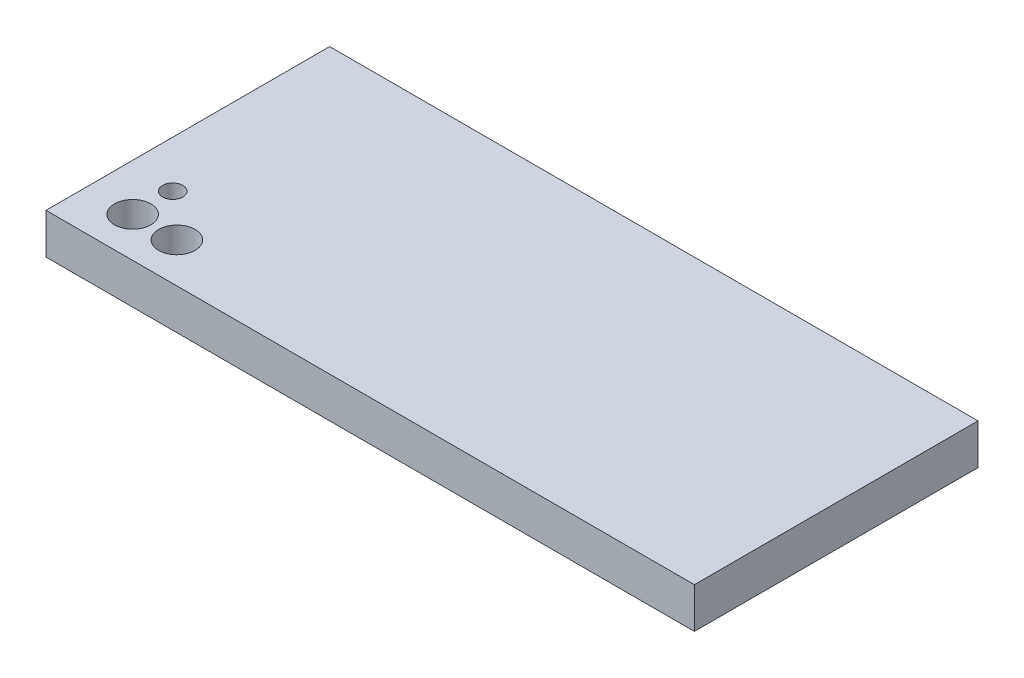
ISO-10303-21;
HEADER;
FILE_DESCRIPTION(('STEP AP214'),'2;1');
FILE_NAME('part.step','',(''),(''),'','','');
FILE_SCHEMA(('AUTOMOTIVE_DESIGN { 1 0 10303 214 1 1 1 1 }'));
ENDSEC;
DATA;
#1=APPLICATION_CONTEXT('core data for automotive mechanical design processes');
#2=APPLICATION_PROTOCOL_DEFINITION('international standard','automotive_design',2000,#1);
#3=PRODUCT_CONTEXT('',#1,'mechanical');
#4=PRODUCT('Part','Part','',(#3));
#5=PRODUCT_RELATED_PRODUCT_CATEGORY('part','',(#4));
#6=PRODUCT_DEFINITION_FORMATION('','',#4);
#7=PRODUCT_DEFINITION_CONTEXT('part definition',#1,'design');
#8=PRODUCT_DEFINITION('design','',#6,#7);
#9=PRODUCT_DEFINITION_SHAPE('','',#8);
#10=(LENGTH_UNIT() NAMED_UNIT(*) SI_UNIT(.MILLI.,.METRE.));
#11=(NAMED_UNIT(*) PLANE_ANGLE_UNIT() SI_UNIT($,.RADIAN.));
#12=(NAMED_UNIT(*) SI_UNIT($,.STERADIAN.) SOLID_ANGLE_UNIT());
#13=UNCERTAINTY_MEASURE_WITH_UNIT(LENGTH_MEASURE(1.E-05),#10,'distance_accuracy_value','');
#14=(GEOMETRIC_REPRESENTATION_CONTEXT(3) GLOBAL_UNCERTAINTY_ASSIGNED_CONTEXT((#13)) GLOBAL_UNIT_ASSIGNED_CONTEXT((#10,
#11,#12)) REPRESENTATION_CONTEXT('',''));
#15=CARTESIAN_POINT('',(0.,0.,0.));
#16=DIRECTION('',(0.,0.,1.));
#17=DIRECTION('',(1.,0.,0.));
#18=AXIS2_PLACEMENT_3D('',#15,#16,#17);
#19=CARTESIAN_POINT('',(80.,-10.,-35.));
#20=DIRECTION('',(1.,0.,0.));
#21=DIRECTION('',(0.,0.,-1.));
#22=AXIS2_PLACEMENT_3D('',#19,#20,#21);
#23=PLANE('',#22);
#24=DIRECTION('',(0.,0.,-1.));
#25=VECTOR('',#24,1.);
#26=CARTESIAN_POINT('',(80.,0.,-35.));
#27=LINE('',#26,#25);
#28=CARTESIAN_POINT('',(80.,0.,35.));
#29=VERTEX_POINT('',#28);
#30=CARTESIAN_POINT('',(80.,0.,-35.));
#31=VERTEX_POINT('',#30);
#32=EDGE_CURVE('E114',#29,#31,#27,.T.);
#33=ORIENTED_EDGE('',*,*,#32,.F.);
#34=DIRECTION('',(0.,1.,0.));
#35=VECTOR('',#34,1.);
#36=CARTESIAN_POINT('',(80.,-10.,35.));
#37=LINE('',#36,#35);
#38=CARTESIAN_POINT('',(80.,-10.,35.));
#39=VERTEX_POINT('',#38);
#40=EDGE_CURVE('E11',#39,#29,#37,.T.);
#41=ORIENTED_EDGE('',*,*,#40,.F.);
#42=DIRECTION('',(0.,0.,-1.));
#43=VECTOR('',#42,1.);
#44=CARTESIAN_POINT('',(80.,-10.,-35.));
#45=LINE('',#44,#43);
#46=CARTESIAN_POINT('',(80.,-10.,-35.));
#47=VERTEX_POINT('',#46);
#48=EDGE_CURVE('E105',#39,#47,#45,.T.);
#49=ORIENTED_EDGE('',*,*,#48,.T.);
#50=DIRECTION('',(0.,1.,0.));
#51=VECTOR('',#50,1.);
#52=CARTESIAN_POINT('',(80.,-10.,-35.));
#53=LINE('',#52,#51);
#54=EDGE_CURVE('E46',#47,#31,#53,.T.);
#55=ORIENTED_EDGE('',*,*,#54,.T.);
#56=EDGE_LOOP('',(#33,#41,#49,#55));
#57=FACE_BOUND('',#56,.T.);
#58=ADVANCED_FACE('F43',(#57),#23,.T.);
#59=CARTESIAN_POINT('',(-80.,-10.,35.));
#60=DIRECTION('',(0.,0.,1.));
#61=DIRECTION('',(1.,0.,0.));
#62=AXIS2_PLACEMENT_3D('',#59,#60,#61);
#63=PLANE('',#62);
#64=DIRECTION('',(1.,0.,0.));
#65=VECTOR('',#64,1.);
#66=CARTESIAN_POINT('',(-80.,0.,35.));
#67=LINE('',#66,#65);
#68=CARTESIAN_POINT('',(-80.,0.,35.));
#69=VERTEX_POINT('',#68);
#70=EDGE_CURVE('E108',#69,#29,#67,.T.);
#71=ORIENTED_EDGE('',*,*,#70,.F.);
#72=DIRECTION('',(0.,1.,0.));
#73=VECTOR('',#72,1.);
#74=CARTESIAN_POINT('',(-80.,-10.,35.));
#75=LINE('',#74,#73);
#76=CARTESIAN_POINT('',(-80.,-10.,35.));
#77=VERTEX_POINT('',#76);
#78=EDGE_CURVE('E53',#77,#69,#75,.T.);
#79=ORIENTED_EDGE('',*,*,#78,.F.);
#80=DIRECTION('',(1.,0.,0.));
#81=VECTOR('',#80,1.);
#82=CARTESIAN_POINT('',(-80.,-10.,35.));
#83=LINE('',#82,#81);
#84=EDGE_CURVE('E100',#77,#39,#83,.T.);
#85=ORIENTED_EDGE('',*,*,#84,.T.);
#86=ORIENTED_EDGE('',*,*,#40,.T.);
#87=EDGE_LOOP('',(#71,#79,#85,#86));
#88=FACE_BOUND('',#87,.T.);
#89=ADVANCED_FACE('F131',(#88),#63,.T.);
#90=CARTESIAN_POINT('',(-80.,-10.,-35.));
#91=DIRECTION('',(-1.,0.,0.));
#92=DIRECTION('',(0.,0.,1.));
#93=AXIS2_PLACEMENT_3D('',#90,#91,#92);
#94=PLANE('',#93);
#95=DIRECTION('',(0.,0.,1.));
#96=VECTOR('',#95,1.);
#97=CARTESIAN_POINT('',(-80.,0.,-35.));
#98=LINE('',#97,#96);
#99=CARTESIAN_POINT('',(-80.,0.,-35.));
#100=VERTEX_POINT('',#99);
#101=EDGE_CURVE('E94',#100,#69,#98,.T.);
#102=ORIENTED_EDGE('',*,*,#101,.F.);
#103=DIRECTION('',(0.,1.,0.));
#104=VECTOR('',#103,1.);
#105=CARTESIAN_POINT('',(-80.,-10.,-35.));
#106=LINE('',#105,#104);
#107=CARTESIAN_POINT('',(-80.,-10.,-35.));
#108=VERTEX_POINT('',#107);
#109=EDGE_CURVE('E89',#108,#100,#106,.T.);
#110=ORIENTED_EDGE('',*,*,#109,.F.);
#111=DIRECTION('',(0.,0.,1.));
#112=VECTOR('',#111,1.);
#113=CARTESIAN_POINT('',(-80.,-10.,-35.));
#114=LINE('',#113,#112);
#115=EDGE_CURVE('E92',#108,#77,#114,.T.);
#116=ORIENTED_EDGE('',*,*,#115,.T.);
#117=ORIENTED_EDGE('',*,*,#78,.T.);
#118=EDGE_LOOP('',(#102,#110,#116,#117));
#119=FACE_BOUND('',#118,.T.);
#120=ADVANCED_FACE('F91',(#119),#94,.T.);
#121=CARTESIAN_POINT('',(-80.,-10.,-35.));
#122=DIRECTION('',(0.,0.,-1.));
#123=DIRECTION('',(-1.,0.,0.));
#124=AXIS2_PLACEMENT_3D('',#121,#122,#123);
#125=PLANE('',#124);
#126=DIRECTION('',(-1.,0.,0.));
#127=VECTOR('',#126,1.);
#128=CARTESIAN_POINT('',(-80.,0.,-35.));
#129=LINE('',#128,#127);
#130=EDGE_CURVE('E118',#31,#100,#129,.T.);
#131=ORIENTED_EDGE('',*,*,#130,.F.);
#132=ORIENTED_EDGE('',*,*,#54,.F.);
#133=DIRECTION('',(-1.,0.,0.));
#134=VECTOR('',#133,1.);
#135=CARTESIAN_POINT('',(-80.,-10.,-35.));
#136=LINE('',#135,#134);
#137=EDGE_CURVE('E99',#47,#108,#136,.T.);
#138=ORIENTED_EDGE('',*,*,#137,.T.);
#139=ORIENTED_EDGE('',*,*,#109,.T.);
#140=EDGE_LOOP('',(#131,#132,#138,#139));
#141=FACE_BOUND('',#140,.T.);
#142=ADVANCED_FACE('F103',(#141),#125,.T.);
#143=CARTESIAN_POINT('',(0.,-10.,0.));
#144=DIRECTION('',(0.,1.,0.));
#145=DIRECTION('',(0.,0.,1.));
#146=AXIS2_PLACEMENT_3D('',#143,#144,#145);
#147=PLANE('',#146);
#148=CARTESIAN_POINT('',(-57.531177100224,-10.,25.169889981348));
#149=DIRECTION('',(0.,1.,0.));
#150=DIRECTION('',(0.,0.,1.));
#151=AXIS2_PLACEMENT_3D('',#148,#149,#150);
#152=CIRCLE('',#151,4.5);
#153=CARTESIAN_POINT('',(-57.531177100224,-10.,29.669889981348));
#154=VERTEX_POINT('',#153);
#155=EDGE_CURVE('E168',#154,#154,#152,.T.);
#156=ORIENTED_EDGE('',*,*,#155,.T.);
#157=EDGE_LOOP('',(#156));
#158=FACE_BOUND('',#157,.T.);
#159=CARTESIAN_POINT('',(-68.4461145432857,-10.,15.2836649960141));
#160=DIRECTION('',(0.,1.,0.));
#161=DIRECTION('',(0.,0.,1.));
#162=AXIS2_PLACEMENT_3D('',#159,#160,#161);
#163=CIRCLE('',#162,2.5);
#164=CARTESIAN_POINT('',(-68.4461145432857,-10.,17.7836649960141));
#165=VERTEX_POINT('',#164);
#166=EDGE_CURVE('E178',#165,#165,#163,.T.);
#167=ORIENTED_EDGE('',*,*,#166,.T.);
#168=EDGE_LOOP('',(#167));
#169=FACE_BOUND('',#168,.T.);
#170=CARTESIAN_POINT('',(-68.4461145432857,-10.,25.169889981348));
#171=DIRECTION('',(0.,1.,0.));
#172=DIRECTION('',(0.,0.,1.));
#173=AXIS2_PLACEMENT_3D('',#170,#171,#172);
#174=CIRCLE('',#173,4.5);
#175=CARTESIAN_POINT('',(-68.4461145432857,-10.,29.669889981348));
#176=VERTEX_POINT('',#175);
#177=EDGE_CURVE('E119',#176,#176,#174,.T.);
#178=ORIENTED_EDGE('',*,*,#177,.T.);
#179=EDGE_LOOP('',(#178));
#180=FACE_BOUND('',#179,.T.);
#181=ORIENTED_EDGE('',*,*,#48,.F.);
#182=ORIENTED_EDGE('',*,*,#84,.F.);
#183=ORIENTED_EDGE('',*,*,#115,.F.);
#184=ORIENTED_EDGE('',*,*,#137,.F.);
#185=EDGE_LOOP('',(#181,#182,#183,#184));
#186=FACE_BOUND('',#185,.T.);
#187=ADVANCED_FACE('F98',(#158,#169,#180,#186),#147,.F.);
#188=CARTESIAN_POINT('',(0.,0.,0.));
#189=DIRECTION('',(0.,1.,0.));
#190=DIRECTION('',(0.,0.,1.));
#191=AXIS2_PLACEMENT_3D('',#188,#189,#190);
#192=PLANE('',#191);
#193=CARTESIAN_POINT('',(-57.531177100224,0.,25.169889981348));
#194=DIRECTION('',(0.,1.,0.));
#195=DIRECTION('',(0.,0.,1.));
#196=AXIS2_PLACEMENT_3D('',#193,#194,#195);
#197=CIRCLE('',#196,4.5);
#198=CARTESIAN_POINT('',(-57.531177100224,0.,29.669889981348));
#199=VERTEX_POINT('',#198);
#200=EDGE_CURVE('E171',#199,#199,#197,.T.);
#201=ORIENTED_EDGE('',*,*,#200,.F.);
#202=EDGE_LOOP('',(#201));
#203=FACE_BOUND('',#202,.T.);
#204=CARTESIAN_POINT('',(-68.4461145432857,0.,15.2836649960141));
#205=DIRECTION('',(0.,1.,0.));
#206=DIRECTION('',(0.,0.,1.));
#207=AXIS2_PLACEMENT_3D('',#204,#205,#206);
#208=CIRCLE('',#207,2.5);
#209=CARTESIAN_POINT('',(-68.4461145432857,0.,17.7836649960141));
#210=VERTEX_POINT('',#209);
#211=EDGE_CURVE('E175',#210,#210,#208,.T.);
#212=ORIENTED_EDGE('',*,*,#211,.F.);
#213=EDGE_LOOP('',(#212));
#214=FACE_BOUND('',#213,.T.);
#215=CARTESIAN_POINT('',(-68.4461145432857,0.,25.169889981348));
#216=DIRECTION('',(0.,1.,0.));
#217=DIRECTION('',(0.,0.,1.));
#218=AXIS2_PLACEMENT_3D('',#215,#216,#217);
#219=CIRCLE('',#218,4.5);
#220=CARTESIAN_POINT('',(-68.4461145432857,0.,29.669889981348));
#221=VERTEX_POINT('',#220);
#222=EDGE_CURVE('E182',#221,#221,#219,.T.);
#223=ORIENTED_EDGE('',*,*,#222,.F.);
#224=EDGE_LOOP('',(#223));
#225=FACE_BOUND('',#224,.T.);
#226=ORIENTED_EDGE('',*,*,#32,.T.);
#227=ORIENTED_EDGE('',*,*,#130,.T.);
#228=ORIENTED_EDGE('',*,*,#101,.T.);
#229=ORIENTED_EDGE('',*,*,#70,.T.);
#230=EDGE_LOOP('',(#226,#227,#228,#229));
#231=FACE_BOUND('',#230,.T.);
#232=ADVANCED_FACE('F130',(#203,#214,#225,#231),#192,.T.);
#233=CARTESIAN_POINT('',(-68.4461145432857,-10.,25.169889981348));
#234=DIRECTION('',(0.,1.,0.));
#235=DIRECTION('',(0.,0.,1.));
#236=AXIS2_PLACEMENT_3D('',#233,#234,#235);
#237=CYLINDRICAL_SURFACE('',#236,4.5);
#238=ORIENTED_EDGE('',*,*,#177,.F.);
#239=EDGE_LOOP('',(#238));
#240=FACE_BOUND('',#239,.T.);
#241=ORIENTED_EDGE('',*,*,#222,.T.);
#242=EDGE_LOOP('',(#241));
#243=FACE_BOUND('',#242,.T.);
#244=ADVANCED_FACE('F149',(#240,#243),#237,.F.);
#245=CARTESIAN_POINT('',(-68.4461145432857,-10.,15.2836649960141));
#246=DIRECTION('',(0.,1.,0.));
#247=DIRECTION('',(0.,0.,1.));
#248=AXIS2_PLACEMENT_3D('',#245,#246,#247);
#249=CYLINDRICAL_SURFACE('',#248,2.5);
#250=ORIENTED_EDGE('',*,*,#166,.F.);
#251=EDGE_LOOP('',(#250));
#252=FACE_BOUND('',#251,.T.);
#253=ORIENTED_EDGE('',*,*,#211,.T.);
#254=EDGE_LOOP('',(#253));
#255=FACE_BOUND('',#254,.T.);
#256=ADVANCED_FACE('F156',(#252,#255),#249,.F.);
#257=CARTESIAN_POINT('',(-57.531177100224,-10.,25.169889981348));
#258=DIRECTION('',(0.,1.,0.));
#259=DIRECTION('',(0.,0.,1.));
#260=AXIS2_PLACEMENT_3D('',#257,#258,#259);
#261=CYLINDRICAL_SURFACE('',#260,4.5);
#262=ORIENTED_EDGE('',*,*,#155,.F.);
#263=EDGE_LOOP('',(#262));
#264=FACE_BOUND('',#263,.T.);
#265=ORIENTED_EDGE('',*,*,#200,.T.);
#266=EDGE_LOOP('',(#265));
#267=FACE_BOUND('',#266,.T.);
#268=ADVANCED_FACE('F160',(#264,#267),#261,.F.);
#269=CLOSED_SHELL('',(#58,#89,#120,#142,#187,#232,#244,#256,#268));
#270=MANIFOLD_SOLID_BREP('B2',#269);
#271=ADVANCED_BREP_SHAPE_REPRESENTATION('',(#18,#270),#14);
#272=SHAPE_DEFINITION_REPRESENTATION(#9,#271);
ENDSEC;
END-ISO-10303-21;
